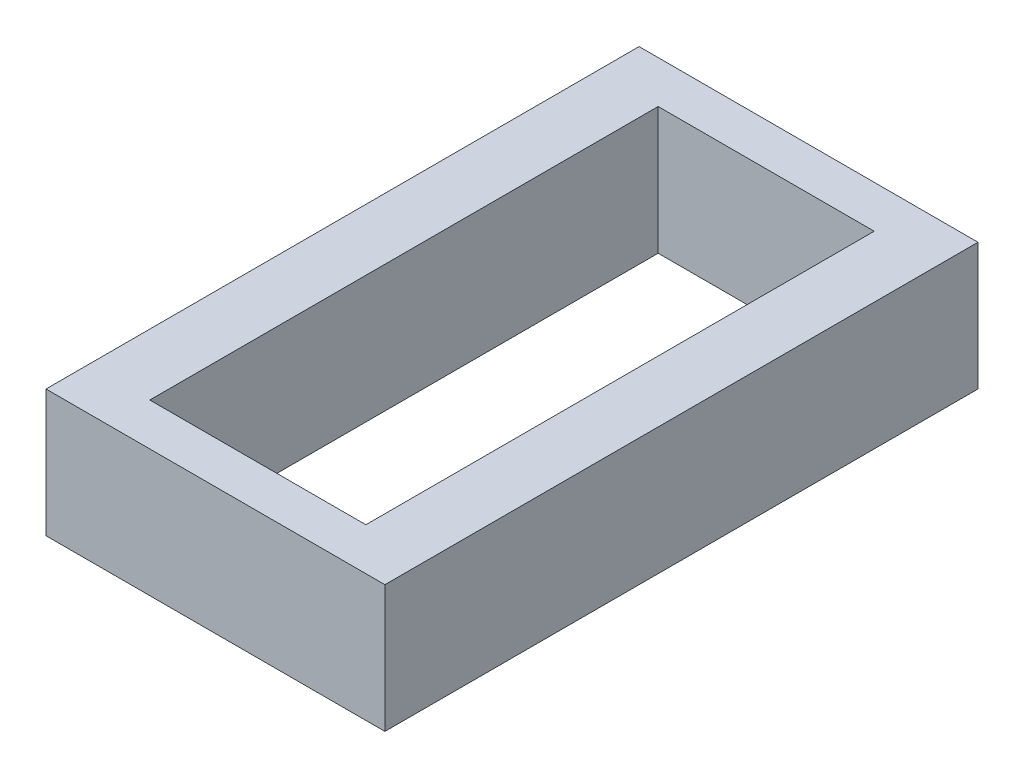
ISO-10303-21;
HEADER;
FILE_DESCRIPTION(('STEP AP214'),'2;1');
FILE_NAME('part.step','',(''),(''),'','','');
FILE_SCHEMA(('AUTOMOTIVE_DESIGN { 1 0 10303 214 1 1 1 1 }'));
ENDSEC;
DATA;
#1=APPLICATION_CONTEXT('core data for automotive mechanical design processes');
#2=APPLICATION_PROTOCOL_DEFINITION('international standard','automotive_design',2000,#1);
#3=PRODUCT_CONTEXT('',#1,'mechanical');
#4=PRODUCT('Part','Part','',(#3));
#5=PRODUCT_RELATED_PRODUCT_CATEGORY('part','',(#4));
#6=PRODUCT_DEFINITION_FORMATION('','',#4);
#7=PRODUCT_DEFINITION_CONTEXT('part definition',#1,'design');
#8=PRODUCT_DEFINITION('design','',#6,#7);
#9=PRODUCT_DEFINITION_SHAPE('','',#8);
#10=(LENGTH_UNIT() NAMED_UNIT(*) SI_UNIT(.MILLI.,.METRE.));
#11=(NAMED_UNIT(*) PLANE_ANGLE_UNIT() SI_UNIT($,.RADIAN.));
#12=(NAMED_UNIT(*) SI_UNIT($,.STERADIAN.) SOLID_ANGLE_UNIT());
#13=UNCERTAINTY_MEASURE_WITH_UNIT(LENGTH_MEASURE(1.E-05),#10,'distance_accuracy_value','');
#14=(GEOMETRIC_REPRESENTATION_CONTEXT(3) GLOBAL_UNCERTAINTY_ASSIGNED_CONTEXT((#13)) GLOBAL_UNIT_ASSIGNED_CONTEXT((#10,
#11,#12)) REPRESENTATION_CONTEXT('',''));
#15=CARTESIAN_POINT('',(0.,0.,0.));
#16=DIRECTION('',(0.,0.,1.));
#17=DIRECTION('',(1.,0.,0.));
#18=AXIS2_PLACEMENT_3D('',#15,#16,#17);
#19=CARTESIAN_POINT('',(0.,3.,0.));
#20=DIRECTION('',(0.,1.,0.));
#21=DIRECTION('',(0.,0.,1.));
#22=AXIS2_PLACEMENT_3D('',#19,#20,#21);
#23=PLANE('',#22);
#24=DIRECTION('',(0.,0.,-1.));
#25=VECTOR('',#24,1.);
#26=CARTESIAN_POINT('',(4.,3.,-7.));
#27=LINE('',#26,#25);
#28=CARTESIAN_POINT('',(4.,3.,7.));
#29=VERTEX_POINT('',#28);
#30=CARTESIAN_POINT('',(4.,3.,-7.));
#31=VERTEX_POINT('',#30);
#32=EDGE_CURVE('E159',#29,#31,#27,.T.);
#33=ORIENTED_EDGE('',*,*,#32,.T.);
#34=DIRECTION('',(-1.,0.,0.));
#35=VECTOR('',#34,1.);
#36=CARTESIAN_POINT('',(-4.,3.,-7.));
#37=LINE('',#36,#35);
#38=CARTESIAN_POINT('',(-4.,3.,-7.));
#39=VERTEX_POINT('',#38);
#40=EDGE_CURVE('E163',#31,#39,#37,.T.);
#41=ORIENTED_EDGE('',*,*,#40,.T.);
#42=DIRECTION('',(0.,0.,1.));
#43=VECTOR('',#42,1.);
#44=CARTESIAN_POINT('',(-4.,3.,-7.));
#45=LINE('',#44,#43);
#46=CARTESIAN_POINT('',(-4.,3.,7.));
#47=VERTEX_POINT('',#46);
#48=EDGE_CURVE('E167',#39,#47,#45,.T.);
#49=ORIENTED_EDGE('',*,*,#48,.T.);
#50=DIRECTION('',(1.,0.,0.));
#51=VECTOR('',#50,1.);
#52=CARTESIAN_POINT('',(-4.,3.,7.));
#53=LINE('',#52,#51);
#54=EDGE_CURVE('E170',#47,#29,#53,.T.);
#55=ORIENTED_EDGE('',*,*,#54,.T.);
#56=EDGE_LOOP('',(#33,#41,#49,#55));
#57=FACE_BOUND('',#56,.T.);
#58=DIRECTION('',(-1.,0.,0.));
#59=VECTOR('',#58,1.);
#60=CARTESIAN_POINT('',(-2.55,3.,-6.));
#61=LINE('',#60,#59);
#62=CARTESIAN_POINT('',(2.55,3.,-6.));
#63=VERTEX_POINT('',#62);
#64=CARTESIAN_POINT('',(-2.55,3.,-6.));
#65=VERTEX_POINT('',#64);
#66=EDGE_CURVE('E120',#63,#65,#61,.T.);
#67=ORIENTED_EDGE('',*,*,#66,.F.);
#68=DIRECTION('',(0.,0.,-1.));
#69=VECTOR('',#68,1.);
#70=CARTESIAN_POINT('',(2.55,3.,-6.));
#71=LINE('',#70,#69);
#72=CARTESIAN_POINT('',(2.55,3.,6.));
#73=VERTEX_POINT('',#72);
#74=EDGE_CURVE('E111',#73,#63,#71,.T.);
#75=ORIENTED_EDGE('',*,*,#74,.F.);
#76=DIRECTION('',(1.,0.,0.));
#77=VECTOR('',#76,1.);
#78=CARTESIAN_POINT('',(-2.55,3.,6.));
#79=LINE('',#78,#77);
#80=CARTESIAN_POINT('',(-2.55,3.,6.));
#81=VERTEX_POINT('',#80);
#82=EDGE_CURVE('E137',#81,#73,#79,.T.);
#83=ORIENTED_EDGE('',*,*,#82,.F.);
#84=DIRECTION('',(0.,0.,1.));
#85=VECTOR('',#84,1.);
#86=CARTESIAN_POINT('',(-2.55,3.,-6.));
#87=LINE('',#86,#85);
#88=EDGE_CURVE('E133',#65,#81,#87,.T.);
#89=ORIENTED_EDGE('',*,*,#88,.F.);
#90=EDGE_LOOP('',(#67,#75,#83,#89));
#91=FACE_BOUND('',#90,.T.);
#92=ADVANCED_FACE('F45',(#57,#91),#23,.T.);
#93=CARTESIAN_POINT('',(0.,0.,0.));
#94=DIRECTION('',(0.,1.,0.));
#95=DIRECTION('',(0.,0.,1.));
#96=AXIS2_PLACEMENT_3D('',#93,#94,#95);
#97=PLANE('',#96);
#98=DIRECTION('',(0.,0.,-1.));
#99=VECTOR('',#98,1.);
#100=CARTESIAN_POINT('',(4.,0.,-7.));
#101=LINE('',#100,#99);
#102=CARTESIAN_POINT('',(4.,0.,7.));
#103=VERTEX_POINT('',#102);
#104=CARTESIAN_POINT('',(4.,0.,-7.));
#105=VERTEX_POINT('',#104);
#106=EDGE_CURVE('E129',#103,#105,#101,.T.);
#107=ORIENTED_EDGE('',*,*,#106,.F.);
#108=DIRECTION('',(1.,0.,0.));
#109=VECTOR('',#108,1.);
#110=CARTESIAN_POINT('',(-4.,0.,7.));
#111=LINE('',#110,#109);
#112=CARTESIAN_POINT('',(-4.,0.,7.));
#113=VERTEX_POINT('',#112);
#114=EDGE_CURVE('E164',#113,#103,#111,.T.);
#115=ORIENTED_EDGE('',*,*,#114,.F.);
#116=DIRECTION('',(0.,0.,1.));
#117=VECTOR('',#116,1.);
#118=CARTESIAN_POINT('',(-4.,0.,-7.));
#119=LINE('',#118,#117);
#120=CARTESIAN_POINT('',(-4.,0.,-7.));
#121=VERTEX_POINT('',#120);
#122=EDGE_CURVE('E180',#121,#113,#119,.T.);
#123=ORIENTED_EDGE('',*,*,#122,.F.);
#124=DIRECTION('',(-1.,0.,0.));
#125=VECTOR('',#124,1.);
#126=CARTESIAN_POINT('',(-4.,0.,-7.));
#127=LINE('',#126,#125);
#128=EDGE_CURVE('E177',#105,#121,#127,.T.);
#129=ORIENTED_EDGE('',*,*,#128,.F.);
#130=EDGE_LOOP('',(#107,#115,#123,#129));
#131=FACE_BOUND('',#130,.T.);
#132=DIRECTION('',(0.,0.,-1.));
#133=VECTOR('',#132,1.);
#134=CARTESIAN_POINT('',(2.55,0.,-6.));
#135=LINE('',#134,#133);
#136=CARTESIAN_POINT('',(2.55,0.,6.));
#137=VERTEX_POINT('',#136);
#138=CARTESIAN_POINT('',(2.55,0.,-6.));
#139=VERTEX_POINT('',#138);
#140=EDGE_CURVE('E69',#137,#139,#135,.T.);
#141=ORIENTED_EDGE('',*,*,#140,.T.);
#142=DIRECTION('',(-1.,0.,0.));
#143=VECTOR('',#142,1.);
#144=CARTESIAN_POINT('',(-2.55,0.,-6.));
#145=LINE('',#144,#143);
#146=CARTESIAN_POINT('',(-2.55,0.,-6.));
#147=VERTEX_POINT('',#146);
#148=EDGE_CURVE('E127',#139,#147,#145,.T.);
#149=ORIENTED_EDGE('',*,*,#148,.T.);
#150=DIRECTION('',(0.,0.,1.));
#151=VECTOR('',#150,1.);
#152=CARTESIAN_POINT('',(-2.55,0.,-6.));
#153=LINE('',#152,#151);
#154=CARTESIAN_POINT('',(-2.55,0.,6.));
#155=VERTEX_POINT('',#154);
#156=EDGE_CURVE('E146',#147,#155,#153,.T.);
#157=ORIENTED_EDGE('',*,*,#156,.T.);
#158=DIRECTION('',(1.,0.,0.));
#159=VECTOR('',#158,1.);
#160=CARTESIAN_POINT('',(-2.55,0.,6.));
#161=LINE('',#160,#159);
#162=EDGE_CURVE('E121',#155,#137,#161,.T.);
#163=ORIENTED_EDGE('',*,*,#162,.T.);
#164=EDGE_LOOP('',(#141,#149,#157,#163));
#165=FACE_BOUND('',#164,.T.);
#166=ADVANCED_FACE('F203',(#131,#165),#97,.F.);
#167=CARTESIAN_POINT('',(4.,3.,-7.));
#168=DIRECTION('',(-1.,0.,0.));
#169=DIRECTION('',(0.,0.,1.));
#170=AXIS2_PLACEMENT_3D('',#167,#168,#169);
#171=PLANE('',#170);
#172=ORIENTED_EDGE('',*,*,#106,.T.);
#173=DIRECTION('',(0.,-1.,0.));
#174=VECTOR('',#173,1.);
#175=CARTESIAN_POINT('',(4.,3.,-7.));
#176=LINE('',#175,#174);
#177=EDGE_CURVE('E11',#31,#105,#176,.T.);
#178=ORIENTED_EDGE('',*,*,#177,.F.);
#179=ORIENTED_EDGE('',*,*,#32,.F.);
#180=DIRECTION('',(0.,-1.,0.));
#181=VECTOR('',#180,1.);
#182=CARTESIAN_POINT('',(4.,3.,7.));
#183=LINE('',#182,#181);
#184=EDGE_CURVE('E173',#29,#103,#183,.T.);
#185=ORIENTED_EDGE('',*,*,#184,.T.);
#186=EDGE_LOOP('',(#172,#178,#179,#185));
#187=FACE_BOUND('',#186,.T.);
#188=ADVANCED_FACE('F47',(#187),#171,.F.);
#189=CARTESIAN_POINT('',(-4.,3.,-7.));
#190=DIRECTION('',(0.,0.,1.));
#191=DIRECTION('',(1.,0.,0.));
#192=AXIS2_PLACEMENT_3D('',#189,#190,#191);
#193=PLANE('',#192);
#194=ORIENTED_EDGE('',*,*,#128,.T.);
#195=DIRECTION('',(0.,-1.,0.));
#196=VECTOR('',#195,1.);
#197=CARTESIAN_POINT('',(-4.,3.,-7.));
#198=LINE('',#197,#196);
#199=EDGE_CURVE('E54',#39,#121,#198,.T.);
#200=ORIENTED_EDGE('',*,*,#199,.F.);
#201=ORIENTED_EDGE('',*,*,#40,.F.);
#202=ORIENTED_EDGE('',*,*,#177,.T.);
#203=EDGE_LOOP('',(#194,#200,#201,#202));
#204=FACE_BOUND('',#203,.T.);
#205=ADVANCED_FACE('F213',(#204),#193,.F.);
#206=CARTESIAN_POINT('',(-4.,3.,-7.));
#207=DIRECTION('',(1.,0.,0.));
#208=DIRECTION('',(0.,0.,-1.));
#209=AXIS2_PLACEMENT_3D('',#206,#207,#208);
#210=PLANE('',#209);
#211=ORIENTED_EDGE('',*,*,#122,.T.);
#212=DIRECTION('',(0.,-1.,0.));
#213=VECTOR('',#212,1.);
#214=CARTESIAN_POINT('',(-4.,3.,7.));
#215=LINE('',#214,#213);
#216=EDGE_CURVE('E188',#47,#113,#215,.T.);
#217=ORIENTED_EDGE('',*,*,#216,.F.);
#218=ORIENTED_EDGE('',*,*,#48,.F.);
#219=ORIENTED_EDGE('',*,*,#199,.T.);
#220=EDGE_LOOP('',(#211,#217,#218,#219));
#221=FACE_BOUND('',#220,.T.);
#222=ADVANCED_FACE('F197',(#221),#210,.F.);
#223=CARTESIAN_POINT('',(-4.,3.,7.));
#224=DIRECTION('',(0.,0.,-1.));
#225=DIRECTION('',(-1.,0.,0.));
#226=AXIS2_PLACEMENT_3D('',#223,#224,#225);
#227=PLANE('',#226);
#228=ORIENTED_EDGE('',*,*,#114,.T.);
#229=ORIENTED_EDGE('',*,*,#184,.F.);
#230=ORIENTED_EDGE('',*,*,#54,.F.);
#231=ORIENTED_EDGE('',*,*,#216,.T.);
#232=EDGE_LOOP('',(#228,#229,#230,#231));
#233=FACE_BOUND('',#232,.T.);
#234=ADVANCED_FACE('F207',(#233),#227,.F.);
#235=CARTESIAN_POINT('',(2.55,3.,-6.));
#236=DIRECTION('',(-1.,0.,0.));
#237=DIRECTION('',(0.,0.,1.));
#238=AXIS2_PLACEMENT_3D('',#235,#236,#237);
#239=PLANE('',#238);
#240=ORIENTED_EDGE('',*,*,#140,.F.);
#241=DIRECTION('',(0.,-1.,0.));
#242=VECTOR('',#241,1.);
#243=CARTESIAN_POINT('',(2.55,3.,6.));
#244=LINE('',#243,#242);
#245=EDGE_CURVE('E115',#73,#137,#244,.T.);
#246=ORIENTED_EDGE('',*,*,#245,.F.);
#247=ORIENTED_EDGE('',*,*,#74,.T.);
#248=DIRECTION('',(0.,-1.,0.));
#249=VECTOR('',#248,1.);
#250=CARTESIAN_POINT('',(2.55,3.,-6.));
#251=LINE('',#250,#249);
#252=EDGE_CURVE('E114',#63,#139,#251,.T.);
#253=ORIENTED_EDGE('',*,*,#252,.T.);
#254=EDGE_LOOP('',(#240,#246,#247,#253));
#255=FACE_BOUND('',#254,.T.);
#256=ADVANCED_FACE('F113',(#255),#239,.T.);
#257=CARTESIAN_POINT('',(-2.55,3.,-6.));
#258=DIRECTION('',(0.,0.,1.));
#259=DIRECTION('',(1.,0.,0.));
#260=AXIS2_PLACEMENT_3D('',#257,#258,#259);
#261=PLANE('',#260);
#262=ORIENTED_EDGE('',*,*,#148,.F.);
#263=ORIENTED_EDGE('',*,*,#252,.F.);
#264=ORIENTED_EDGE('',*,*,#66,.T.);
#265=DIRECTION('',(0.,-1.,0.));
#266=VECTOR('',#265,1.);
#267=CARTESIAN_POINT('',(-2.55,3.,-6.));
#268=LINE('',#267,#266);
#269=EDGE_CURVE('E130',#65,#147,#268,.T.);
#270=ORIENTED_EDGE('',*,*,#269,.T.);
#271=EDGE_LOOP('',(#262,#263,#264,#270));
#272=FACE_BOUND('',#271,.T.);
#273=ADVANCED_FACE('F124',(#272),#261,.T.);
#274=CARTESIAN_POINT('',(-2.55,3.,-6.));
#275=DIRECTION('',(1.,0.,0.));
#276=DIRECTION('',(0.,0.,-1.));
#277=AXIS2_PLACEMENT_3D('',#274,#275,#276);
#278=PLANE('',#277);
#279=ORIENTED_EDGE('',*,*,#156,.F.);
#280=ORIENTED_EDGE('',*,*,#269,.F.);
#281=ORIENTED_EDGE('',*,*,#88,.T.);
#282=DIRECTION('',(0.,-1.,0.));
#283=VECTOR('',#282,1.);
#284=CARTESIAN_POINT('',(-2.55,3.,6.));
#285=LINE('',#284,#283);
#286=EDGE_CURVE('E61',#81,#155,#285,.T.);
#287=ORIENTED_EDGE('',*,*,#286,.T.);
#288=EDGE_LOOP('',(#279,#280,#281,#287));
#289=FACE_BOUND('',#288,.T.);
#290=ADVANCED_FACE('F236',(#289),#278,.T.);
#291=CARTESIAN_POINT('',(-2.55,3.,6.));
#292=DIRECTION('',(0.,0.,-1.));
#293=DIRECTION('',(-1.,0.,0.));
#294=AXIS2_PLACEMENT_3D('',#291,#292,#293);
#295=PLANE('',#294);
#296=ORIENTED_EDGE('',*,*,#162,.F.);
#297=ORIENTED_EDGE('',*,*,#286,.F.);
#298=ORIENTED_EDGE('',*,*,#82,.T.);
#299=ORIENTED_EDGE('',*,*,#245,.T.);
#300=EDGE_LOOP('',(#296,#297,#298,#299));
#301=FACE_BOUND('',#300,.T.);
#302=ADVANCED_FACE('F240',(#301),#295,.T.);
#303=CLOSED_SHELL('',(#92,#166,#188,#205,#222,#234,#256,#273,#290,#302));
#304=MANIFOLD_SOLID_BREP('B2',#303);
#305=ADVANCED_BREP_SHAPE_REPRESENTATION('',(#18,#304),#14);
#306=SHAPE_DEFINITION_REPRESENTATION(#9,#305);
ENDSEC;
END-ISO-10303-21;
